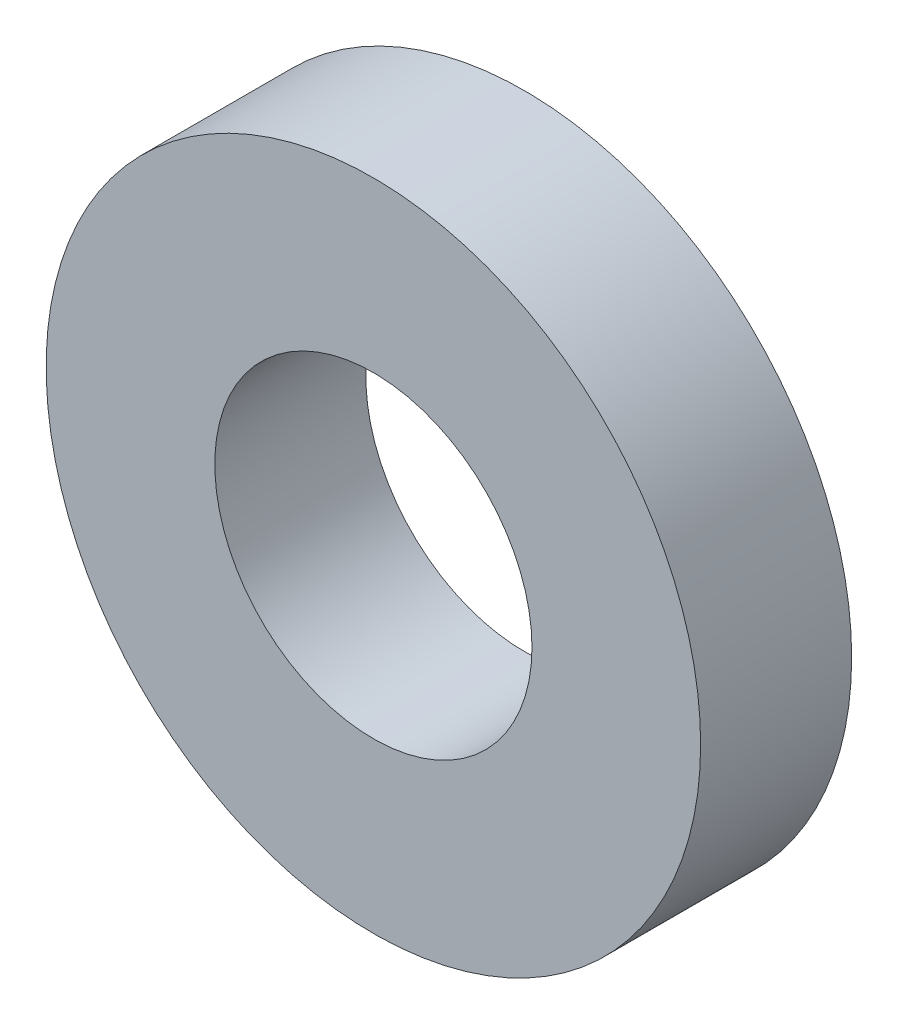
ISO-10303-21;
HEADER;
FILE_DESCRIPTION(('STEP AP214'),'2;1');
FILE_NAME('part.step','',(''),(''),'','','');
FILE_SCHEMA(('AUTOMOTIVE_DESIGN { 1 0 10303 214 1 1 1 1 }'));
ENDSEC;
DATA;
#1=APPLICATION_CONTEXT('core data for automotive mechanical design processes');
#2=APPLICATION_PROTOCOL_DEFINITION('international standard','automotive_design',2000,#1);
#3=PRODUCT_CONTEXT('',#1,'mechanical');
#4=PRODUCT('Part','Part','',(#3));
#5=PRODUCT_RELATED_PRODUCT_CATEGORY('part','',(#4));
#6=PRODUCT_DEFINITION_FORMATION('','',#4);
#7=PRODUCT_DEFINITION_CONTEXT('part definition',#1,'design');
#8=PRODUCT_DEFINITION('design','',#6,#7);
#9=PRODUCT_DEFINITION_SHAPE('','',#8);
#10=(LENGTH_UNIT() NAMED_UNIT(*) SI_UNIT(.MILLI.,.METRE.));
#11=(NAMED_UNIT(*) PLANE_ANGLE_UNIT() SI_UNIT($,.RADIAN.));
#12=(NAMED_UNIT(*) SI_UNIT($,.STERADIAN.) SOLID_ANGLE_UNIT());
#13=UNCERTAINTY_MEASURE_WITH_UNIT(LENGTH_MEASURE(1.E-05),#10,'distance_accuracy_value','');
#14=(GEOMETRIC_REPRESENTATION_CONTEXT(3) GLOBAL_UNCERTAINTY_ASSIGNED_CONTEXT((#13)) GLOBAL_UNIT_ASSIGNED_CONTEXT((#10,
#11,#12)) REPRESENTATION_CONTEXT('',''));
#15=CARTESIAN_POINT('',(0.,0.,0.));
#16=DIRECTION('',(0.,0.,1.));
#17=DIRECTION('',(1.,0.,0.));
#18=AXIS2_PLACEMENT_3D('',#15,#16,#17);
#19=CARTESIAN_POINT('',(0.,0.,1.5));
#20=DIRECTION('',(0.,0.,1.));
#21=DIRECTION('',(1.,0.,0.));
#22=AXIS2_PLACEMENT_3D('',#19,#20,#21);
#23=PLANE('',#22);
#24=CARTESIAN_POINT('',(0.,0.,1.5));
#25=DIRECTION('',(0.,0.,1.));
#26=DIRECTION('',(1.,0.,0.));
#27=AXIS2_PLACEMENT_3D('',#24,#25,#26);
#28=CIRCLE('',#27,6.5);
#29=CARTESIAN_POINT('',(6.5,0.,1.5));
#30=VERTEX_POINT('',#29);
#31=EDGE_CURVE('E10',#30,#30,#28,.T.);
#32=ORIENTED_EDGE('',*,*,#31,.T.);
#33=EDGE_LOOP('',(#32));
#34=FACE_BOUND('',#33,.T.);
#35=CARTESIAN_POINT('',(0.,0.,1.5));
#36=DIRECTION('',(0.,0.,1.));
#37=DIRECTION('',(1.,0.,0.));
#38=AXIS2_PLACEMENT_3D('',#35,#36,#37);
#39=CIRCLE('',#38,3.15);
#40=CARTESIAN_POINT('',(3.15,0.,1.5));
#41=VERTEX_POINT('',#40);
#42=EDGE_CURVE('E41',#41,#41,#39,.T.);
#43=ORIENTED_EDGE('',*,*,#42,.F.);
#44=EDGE_LOOP('',(#43));
#45=FACE_BOUND('',#44,.T.);
#46=ADVANCED_FACE('F30',(#34,#45),#23,.T.);
#47=CARTESIAN_POINT('',(0.,0.,-1.5));
#48=DIRECTION('',(0.,0.,1.));
#49=DIRECTION('',(1.,0.,0.));
#50=AXIS2_PLACEMENT_3D('',#47,#48,#49);
#51=PLANE('',#50);
#52=CARTESIAN_POINT('',(0.,0.,-1.5));
#53=DIRECTION('',(0.,0.,1.));
#54=DIRECTION('',(1.,0.,0.));
#55=AXIS2_PLACEMENT_3D('',#52,#53,#54);
#56=CIRCLE('',#55,6.5);
#57=CARTESIAN_POINT('',(6.5,0.,-1.5));
#58=VERTEX_POINT('',#57);
#59=EDGE_CURVE('E34',#58,#58,#56,.T.);
#60=ORIENTED_EDGE('',*,*,#59,.F.);
#61=EDGE_LOOP('',(#60));
#62=FACE_BOUND('',#61,.T.);
#63=CARTESIAN_POINT('',(0.,0.,-1.5));
#64=DIRECTION('',(0.,0.,1.));
#65=DIRECTION('',(1.,0.,0.));
#66=AXIS2_PLACEMENT_3D('',#63,#64,#65);
#67=CIRCLE('',#66,3.15);
#68=CARTESIAN_POINT('',(3.15,0.,-1.5));
#69=VERTEX_POINT('',#68);
#70=EDGE_CURVE('E43',#69,#69,#67,.T.);
#71=ORIENTED_EDGE('',*,*,#70,.T.);
#72=EDGE_LOOP('',(#71));
#73=FACE_BOUND('',#72,.T.);
#74=ADVANCED_FACE('F53',(#62,#73),#51,.F.);
#75=CARTESIAN_POINT('',(0.,0.,1.5));
#76=DIRECTION('',(0.,0.,-1.));
#77=DIRECTION('',(-1.,0.,0.));
#78=AXIS2_PLACEMENT_3D('',#75,#76,#77);
#79=CYLINDRICAL_SURFACE('',#78,6.5);
#80=ORIENTED_EDGE('',*,*,#31,.F.);
#81=EDGE_LOOP('',(#80));
#82=FACE_BOUND('',#81,.T.);
#83=ORIENTED_EDGE('',*,*,#59,.T.);
#84=EDGE_LOOP('',(#83));
#85=FACE_BOUND('',#84,.T.);
#86=ADVANCED_FACE('F32',(#82,#85),#79,.T.);
#87=CARTESIAN_POINT('',(0.,0.,1.5));
#88=DIRECTION('',(0.,0.,-1.));
#89=DIRECTION('',(-1.,0.,0.));
#90=AXIS2_PLACEMENT_3D('',#87,#88,#89);
#91=CYLINDRICAL_SURFACE('',#90,3.15);
#92=ORIENTED_EDGE('',*,*,#42,.T.);
#93=EDGE_LOOP('',(#92));
#94=FACE_BOUND('',#93,.T.);
#95=ORIENTED_EDGE('',*,*,#70,.F.);
#96=EDGE_LOOP('',(#95));
#97=FACE_BOUND('',#96,.T.);
#98=ADVANCED_FACE('F49',(#94,#97),#91,.F.);
#99=CLOSED_SHELL('',(#46,#74,#86,#98));
#100=MANIFOLD_SOLID_BREP('B2',#99);
#101=ADVANCED_BREP_SHAPE_REPRESENTATION('',(#18,#100),#14);
#102=SHAPE_DEFINITION_REPRESENTATION(#9,#101);
ENDSEC;
END-ISO-10303-21;
